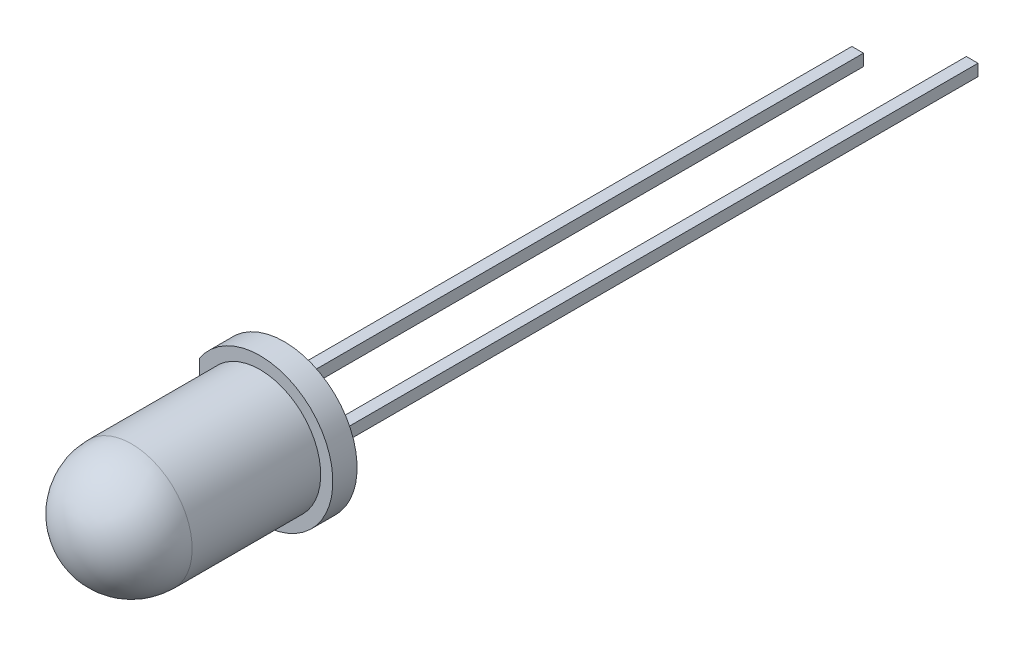
ISO-10303-21;
HEADER;
FILE_DESCRIPTION(('STEP AP214'),'2;1');
FILE_NAME('part.step','',(''),(''),'','','');
FILE_SCHEMA(('AUTOMOTIVE_DESIGN { 1 0 10303 214 1 1 1 1 }'));
ENDSEC;
DATA;
#1=APPLICATION_CONTEXT('core data for automotive mechanical design processes');
#2=APPLICATION_PROTOCOL_DEFINITION('international standard','automotive_design',2000,#1);
#3=PRODUCT_CONTEXT('',#1,'mechanical');
#4=PRODUCT('Part','Part','',(#3));
#5=PRODUCT_RELATED_PRODUCT_CATEGORY('part','',(#4));
#6=PRODUCT_DEFINITION_FORMATION('','',#4);
#7=PRODUCT_DEFINITION_CONTEXT('part definition',#1,'design');
#8=PRODUCT_DEFINITION('design','',#6,#7);
#9=PRODUCT_DEFINITION_SHAPE('','',#8);
#10=(LENGTH_UNIT() NAMED_UNIT(*) SI_UNIT(.MILLI.,.METRE.));
#11=(NAMED_UNIT(*) PLANE_ANGLE_UNIT() SI_UNIT($,.RADIAN.));
#12=(NAMED_UNIT(*) SI_UNIT($,.STERADIAN.) SOLID_ANGLE_UNIT());
#13=UNCERTAINTY_MEASURE_WITH_UNIT(LENGTH_MEASURE(1.E-05),#10,'distance_accuracy_value','');
#14=(GEOMETRIC_REPRESENTATION_CONTEXT(3) GLOBAL_UNCERTAINTY_ASSIGNED_CONTEXT((#13)) GLOBAL_UNIT_ASSIGNED_CONTEXT((#10,
#11,#12)) REPRESENTATION_CONTEXT('',''));
#15=CARTESIAN_POINT('',(0.,0.,0.));
#16=DIRECTION('',(0.,0.,1.));
#17=DIRECTION('',(1.,0.,0.));
#18=AXIS2_PLACEMENT_3D('',#15,#16,#17);
#19=CARTESIAN_POINT('',(-0.0499999999999997,0.,4.26666666666667));
#20=DIRECTION('',(0.,0.,1.));
#21=DIRECTION('',(-1.,0.,0.));
#22=AXIS2_PLACEMENT_3D('',#19,#20,#21);
#23=SPHERICAL_SURFACE('',#22,0.566666666666667);
#24=CARTESIAN_POINT('',(-0.0499999999999997,-0.24,4.26666666666667));
#25=DIRECTION('',(0.,1.,0.));
#26=DIRECTION('',(0.,0.,1.));
#27=AXIS2_PLACEMENT_3D('',#24,#25,#26);
#28=CIRCLE('',#27,0.513333333333333);
#29=CARTESIAN_POINT('',(-0.488634243989226,-0.24,4.));
#30=VERTEX_POINT('',#29);
#31=CARTESIAN_POINT('',(0.388634243989226,-0.24,4.));
#32=VERTEX_POINT('',#31);
#33=EDGE_CURVE('E165',#30,#32,#28,.F.);
#34=ORIENTED_EDGE('',*,*,#33,.T.);
#35=CARTESIAN_POINT('',(-0.0499999999999997,0.,4.));
#36=DIRECTION('',(0.,0.,1.));
#37=DIRECTION('',(1.,0.,0.));
#38=AXIS2_PLACEMENT_3D('',#35,#36,#37);
#39=CIRCLE('',#38,0.5);
#40=EDGE_CURVE('E60',#30,#32,#39,.T.);
#41=ORIENTED_EDGE('',*,*,#40,.F.);
#42=EDGE_LOOP('',(#34,#41));
#43=FACE_BOUND('',#42,.T.);
#44=ADVANCED_FACE('F52',(#43),#23,.T.);
#45=CARTESIAN_POINT('',(0.388634243989226,0.24,4.));
#46=VERTEX_POINT('',#45);
#47=CARTESIAN_POINT('',(-0.488634243989226,0.24,4.));
#48=VERTEX_POINT('',#47);
#49=EDGE_CURVE('E12',#46,#48,#39,.T.);
#50=ORIENTED_EDGE('',*,*,#49,.F.);
#51=CARTESIAN_POINT('',(-0.0499999999999997,0.24,4.26666666666667));
#52=DIRECTION('',(0.,1.,0.));
#53=DIRECTION('',(0.,0.,1.));
#54=AXIS2_PLACEMENT_3D('',#51,#52,#53);
#55=CIRCLE('',#54,0.513333333333333);
#56=EDGE_CURVE('E187',#48,#46,#55,.F.);
#57=ORIENTED_EDGE('',*,*,#56,.F.);
#58=EDGE_LOOP('',(#50,#57));
#59=FACE_BOUND('',#58,.T.);
#60=ADVANCED_FACE('F54',(#59),#23,.T.);
#61=CARTESIAN_POINT('',(-0.55,0.,4.));
#62=DIRECTION('',(0.,0.,-1.));
#63=DIRECTION('',(-1.,0.,0.));
#64=AXIS2_PLACEMENT_3D('',#61,#62,#63);
#65=PLANE('',#64);
#66=CARTESIAN_POINT('',(-0.0499999999999997,0.,4.));
#67=DIRECTION('',(0.,0.,1.));
#68=DIRECTION('',(1.,0.,0.));
#69=AXIS2_PLACEMENT_3D('',#66,#67,#68);
#70=CIRCLE('',#69,0.2);
#71=CARTESIAN_POINT('',(0.15,0.,4.));
#72=VERTEX_POINT('',#71);
#73=EDGE_CURVE('E260',#72,#72,#70,.T.);
#74=ORIENTED_EDGE('',*,*,#73,.F.);
#75=EDGE_LOOP('',(#74));
#76=FACE_BOUND('',#75,.T.);
#77=ORIENTED_EDGE('',*,*,#49,.T.);
#78=DIRECTION('',(1.,0.,0.));
#79=VECTOR('',#78,1.);
#80=CARTESIAN_POINT('',(-1.3,0.24,4.));
#81=LINE('',#80,#79);
#82=CARTESIAN_POINT('',(-1.3,0.24,4.));
#83=VERTEX_POINT('',#82);
#84=EDGE_CURVE('E106',#83,#48,#81,.T.);
#85=ORIENTED_EDGE('',*,*,#84,.F.);
#86=DIRECTION('',(0.,-1.,0.));
#87=VECTOR('',#86,1.);
#88=CARTESIAN_POINT('',(-1.3,0.24,4.));
#89=LINE('',#88,#87);
#90=CARTESIAN_POINT('',(-1.3,-0.24,4.));
#91=VERTEX_POINT('',#90);
#92=EDGE_CURVE('E164',#83,#91,#89,.T.);
#93=ORIENTED_EDGE('',*,*,#92,.T.);
#94=DIRECTION('',(1.,0.,0.));
#95=VECTOR('',#94,1.);
#96=CARTESIAN_POINT('',(-1.3,-0.24,4.));
#97=LINE('',#96,#95);
#98=EDGE_CURVE('E67',#91,#30,#97,.T.);
#99=ORIENTED_EDGE('',*,*,#98,.T.);
#100=ORIENTED_EDGE('',*,*,#40,.T.);
#101=CARTESIAN_POINT('',(1.2,-0.24,4.));
#102=VERTEX_POINT('',#101);
#103=EDGE_CURVE('E150',#32,#102,#97,.T.);
#104=ORIENTED_EDGE('',*,*,#103,.T.);
#105=DIRECTION('',(0.,-1.,0.));
#106=VECTOR('',#105,1.);
#107=CARTESIAN_POINT('',(1.2,0.24,4.));
#108=LINE('',#107,#106);
#109=CARTESIAN_POINT('',(1.2,0.24,4.));
#110=VERTEX_POINT('',#109);
#111=EDGE_CURVE('E134',#110,#102,#108,.T.);
#112=ORIENTED_EDGE('',*,*,#111,.F.);
#113=EDGE_CURVE('E122',#46,#110,#81,.T.);
#114=ORIENTED_EDGE('',*,*,#113,.F.);
#115=EDGE_LOOP('',(#77,#85,#93,#99,#100,#104,#112,#114));
#116=FACE_BOUND('',#115,.T.);
#117=ADVANCED_FACE('F170',(#76,#116),#65,.F.);
#118=CARTESIAN_POINT('',(0.,0.24,0.));
#119=DIRECTION('',(0.,1.,0.));
#120=DIRECTION('',(0.,0.,1.));
#121=AXIS2_PLACEMENT_3D('',#118,#119,#120);
#122=PLANE('',#121);
#123=ORIENTED_EDGE('',*,*,#84,.T.);
#124=ORIENTED_EDGE('',*,*,#56,.T.);
#125=ORIENTED_EDGE('',*,*,#113,.T.);
#126=DIRECTION('',(-0.508148861978286,0.,-0.861269257590315));
#127=VECTOR('',#126,1.);
#128=CARTESIAN_POINT('',(1.2,0.24,4.));
#129=LINE('',#128,#127);
#130=CARTESIAN_POINT('',(0.0199999999999998,0.24,2.));
#131=VERTEX_POINT('',#130);
#132=EDGE_CURVE('E113',#110,#131,#129,.T.);
#133=ORIENTED_EDGE('',*,*,#132,.T.);
#134=DIRECTION('',(-1.,0.,0.));
#135=VECTOR('',#134,1.);
#136=CARTESIAN_POINT('',(0.0199999999999998,0.24,2.));
#137=LINE('',#136,#135);
#138=CARTESIAN_POINT('',(-1.12,0.24,2.));
#139=VERTEX_POINT('',#138);
#140=EDGE_CURVE('E118',#131,#139,#137,.T.);
#141=ORIENTED_EDGE('',*,*,#140,.T.);
#142=DIRECTION('',(0.,0.,-1.));
#143=VECTOR('',#142,1.);
#144=CARTESIAN_POINT('',(-1.12,0.24,2.));
#145=LINE('',#144,#143);
#146=CARTESIAN_POINT('',(-1.12,0.24,-25.));
#147=VERTEX_POINT('',#146);
#148=EDGE_CURVE('E140',#139,#147,#145,.T.);
#149=ORIENTED_EDGE('',*,*,#148,.T.);
#150=DIRECTION('',(1.,0.,0.));
#151=VECTOR('',#150,1.);
#152=CARTESIAN_POINT('',(-1.12,0.24,-25.));
#153=LINE('',#152,#151);
#154=CARTESIAN_POINT('',(-1.6,0.24,-25.));
#155=VERTEX_POINT('',#154);
#156=EDGE_CURVE('E151',#155,#147,#153,.T.);
#157=ORIENTED_EDGE('',*,*,#156,.F.);
#158=DIRECTION('',(0.,0.,1.));
#159=VECTOR('',#158,1.);
#160=CARTESIAN_POINT('',(-1.6,0.24,0.));
#161=LINE('',#160,#159);
#162=CARTESIAN_POINT('',(-1.6,0.24,3.5));
#163=VERTEX_POINT('',#162);
#164=EDGE_CURVE('E76',#155,#163,#161,.T.);
#165=ORIENTED_EDGE('',*,*,#164,.T.);
#166=DIRECTION('',(0.514495755427526,0.,0.857492925712544));
#167=VECTOR('',#166,1.);
#168=CARTESIAN_POINT('',(-1.6,0.24,3.5));
#169=LINE('',#168,#167);
#170=EDGE_CURVE('E160',#163,#83,#169,.T.);
#171=ORIENTED_EDGE('',*,*,#170,.T.);
#172=EDGE_LOOP('',(#123,#124,#125,#133,#141,#149,#157,#165,#171));
#173=FACE_BOUND('',#172,.T.);
#174=ADVANCED_FACE('F115',(#173),#122,.T.);
#175=CARTESIAN_POINT('',(0.,-0.24,0.));
#176=DIRECTION('',(0.,1.,0.));
#177=DIRECTION('',(0.,0.,1.));
#178=AXIS2_PLACEMENT_3D('',#175,#176,#177);
#179=PLANE('',#178);
#180=ORIENTED_EDGE('',*,*,#33,.F.);
#181=ORIENTED_EDGE('',*,*,#98,.F.);
#182=DIRECTION('',(0.514495755427526,0.,0.857492925712544));
#183=VECTOR('',#182,1.);
#184=CARTESIAN_POINT('',(-1.6,-0.24,3.5));
#185=LINE('',#184,#183);
#186=CARTESIAN_POINT('',(-1.6,-0.24,3.5));
#187=VERTEX_POINT('',#186);
#188=EDGE_CURVE('E147',#187,#91,#185,.T.);
#189=ORIENTED_EDGE('',*,*,#188,.F.);
#190=DIRECTION('',(0.,0.,1.));
#191=VECTOR('',#190,1.);
#192=CARTESIAN_POINT('',(-1.6,-0.24,0.));
#193=LINE('',#192,#191);
#194=CARTESIAN_POINT('',(-1.6,-0.24,-25.));
#195=VERTEX_POINT('',#194);
#196=EDGE_CURVE('E100',#195,#187,#193,.T.);
#197=ORIENTED_EDGE('',*,*,#196,.F.);
#198=DIRECTION('',(-1.,0.,0.));
#199=VECTOR('',#198,1.);
#200=CARTESIAN_POINT('',(-1.12,-0.24,-25.));
#201=LINE('',#200,#199);
#202=CARTESIAN_POINT('',(-1.12,-0.24,-25.));
#203=VERTEX_POINT('',#202);
#204=EDGE_CURVE('E208',#203,#195,#201,.T.);
#205=ORIENTED_EDGE('',*,*,#204,.F.);
#206=DIRECTION('',(0.,0.,-1.));
#207=VECTOR('',#206,1.);
#208=CARTESIAN_POINT('',(-1.12,-0.24,2.));
#209=LINE('',#208,#207);
#210=CARTESIAN_POINT('',(-1.12,-0.24,2.));
#211=VERTEX_POINT('',#210);
#212=EDGE_CURVE('E156',#211,#203,#209,.T.);
#213=ORIENTED_EDGE('',*,*,#212,.F.);
#214=DIRECTION('',(-1.,0.,0.));
#215=VECTOR('',#214,1.);
#216=CARTESIAN_POINT('',(0.0199999999999998,-0.24,2.));
#217=LINE('',#216,#215);
#218=CARTESIAN_POINT('',(0.0199999999999998,-0.24,2.));
#219=VERTEX_POINT('',#218);
#220=EDGE_CURVE('E154',#219,#211,#217,.T.);
#221=ORIENTED_EDGE('',*,*,#220,.F.);
#222=DIRECTION('',(-0.508148861978286,0.,-0.861269257590315));
#223=VECTOR('',#222,1.);
#224=CARTESIAN_POINT('',(1.2,-0.24,4.));
#225=LINE('',#224,#223);
#226=EDGE_CURVE('E131',#102,#219,#225,.T.);
#227=ORIENTED_EDGE('',*,*,#226,.F.);
#228=ORIENTED_EDGE('',*,*,#103,.F.);
#229=EDGE_LOOP('',(#180,#181,#189,#197,#205,#213,#221,#227,#228));
#230=FACE_BOUND('',#229,.T.);
#231=ADVANCED_FACE('F222',(#230),#179,.F.);
#232=CARTESIAN_POINT('',(-1.6,0.24,3.5));
#233=DIRECTION('',(0.857492925712544,0.,-0.514495755427526));
#234=DIRECTION('',(-0.514495755427526,0.,-0.857492925712544));
#235=AXIS2_PLACEMENT_3D('',#232,#233,#234);
#236=PLANE('',#235);
#237=ORIENTED_EDGE('',*,*,#188,.T.);
#238=ORIENTED_EDGE('',*,*,#92,.F.);
#239=ORIENTED_EDGE('',*,*,#170,.F.);
#240=DIRECTION('',(0.,-1.,0.));
#241=VECTOR('',#240,1.);
#242=CARTESIAN_POINT('',(-1.6,0.24,3.5));
#243=LINE('',#242,#241);
#244=EDGE_CURVE('E146',#163,#187,#243,.T.);
#245=ORIENTED_EDGE('',*,*,#244,.T.);
#246=EDGE_LOOP('',(#237,#238,#239,#245));
#247=FACE_BOUND('',#246,.T.);
#248=ADVANCED_FACE('F219',(#247),#236,.F.);
#249=CARTESIAN_POINT('',(1.2,0.24,4.));
#250=DIRECTION('',(-0.861269257590315,0.,0.508148861978286));
#251=DIRECTION('',(0.508148861978286,0.,0.861269257590315));
#252=AXIS2_PLACEMENT_3D('',#249,#250,#251);
#253=PLANE('',#252);
#254=ORIENTED_EDGE('',*,*,#226,.T.);
#255=DIRECTION('',(0.,-1.,0.));
#256=VECTOR('',#255,1.);
#257=CARTESIAN_POINT('',(0.0199999999999998,0.24,2.));
#258=LINE('',#257,#256);
#259=EDGE_CURVE('E128',#131,#219,#258,.T.);
#260=ORIENTED_EDGE('',*,*,#259,.F.);
#261=ORIENTED_EDGE('',*,*,#132,.F.);
#262=ORIENTED_EDGE('',*,*,#111,.T.);
#263=EDGE_LOOP('',(#254,#260,#261,#262));
#264=FACE_BOUND('',#263,.T.);
#265=ADVANCED_FACE('F129',(#264),#253,.F.);
#266=CARTESIAN_POINT('',(0.0199999999999998,0.24,2.));
#267=DIRECTION('',(0.,0.,1.));
#268=DIRECTION('',(1.,0.,0.));
#269=AXIS2_PLACEMENT_3D('',#266,#267,#268);
#270=PLANE('',#269);
#271=ORIENTED_EDGE('',*,*,#220,.T.);
#272=DIRECTION('',(0.,-1.,0.));
#273=VECTOR('',#272,1.);
#274=CARTESIAN_POINT('',(-1.12,0.24,2.));
#275=LINE('',#274,#273);
#276=EDGE_CURVE('E135',#139,#211,#275,.T.);
#277=ORIENTED_EDGE('',*,*,#276,.F.);
#278=ORIENTED_EDGE('',*,*,#140,.F.);
#279=ORIENTED_EDGE('',*,*,#259,.T.);
#280=EDGE_LOOP('',(#271,#277,#278,#279));
#281=FACE_BOUND('',#280,.T.);
#282=ADVANCED_FACE('F137',(#281),#270,.F.);
#283=CARTESIAN_POINT('',(-1.12,0.24,2.));
#284=DIRECTION('',(-1.,0.,0.));
#285=DIRECTION('',(0.,0.,1.));
#286=AXIS2_PLACEMENT_3D('',#283,#284,#285);
#287=PLANE('',#286);
#288=ORIENTED_EDGE('',*,*,#212,.T.);
#289=DIRECTION('',(0.,-1.,0.));
#290=VECTOR('',#289,1.);
#291=CARTESIAN_POINT('',(-1.12,-0.24,-25.));
#292=LINE('',#291,#290);
#293=EDGE_CURVE('E202',#147,#203,#292,.T.);
#294=ORIENTED_EDGE('',*,*,#293,.F.);
#295=ORIENTED_EDGE('',*,*,#148,.F.);
#296=ORIENTED_EDGE('',*,*,#276,.T.);
#297=EDGE_LOOP('',(#288,#294,#295,#296));
#298=FACE_BOUND('',#297,.T.);
#299=ADVANCED_FACE('F205',(#298),#287,.F.);
#300=CARTESIAN_POINT('',(-1.6,0.24,0.));
#301=DIRECTION('',(1.,0.,0.));
#302=DIRECTION('',(0.,0.,-1.));
#303=AXIS2_PLACEMENT_3D('',#300,#301,#302);
#304=PLANE('',#303);
#305=ORIENTED_EDGE('',*,*,#196,.T.);
#306=ORIENTED_EDGE('',*,*,#244,.F.);
#307=ORIENTED_EDGE('',*,*,#164,.F.);
#308=DIRECTION('',(0.,1.,0.));
#309=VECTOR('',#308,1.);
#310=CARTESIAN_POINT('',(-1.6,-0.24,-25.));
#311=LINE('',#310,#309);
#312=EDGE_CURVE('E203',#195,#155,#311,.T.);
#313=ORIENTED_EDGE('',*,*,#312,.F.);
#314=EDGE_LOOP('',(#305,#306,#307,#313));
#315=FACE_BOUND('',#314,.T.);
#316=ADVANCED_FACE('F223',(#315),#304,.F.);
#317=CARTESIAN_POINT('',(0.,0.,-25.));
#318=DIRECTION('',(0.,0.,1.));
#319=DIRECTION('',(1.,0.,0.));
#320=AXIS2_PLACEMENT_3D('',#317,#318,#319);
#321=PLANE('',#320);
#322=ORIENTED_EDGE('',*,*,#293,.T.);
#323=ORIENTED_EDGE('',*,*,#204,.T.);
#324=ORIENTED_EDGE('',*,*,#312,.T.);
#325=ORIENTED_EDGE('',*,*,#156,.T.);
#326=EDGE_LOOP('',(#322,#323,#324,#325));
#327=FACE_BOUND('',#326,.T.);
#328=ADVANCED_FACE('F200',(#327),#321,.F.);
#329=CARTESIAN_POINT('',(-0.0499999999999997,0.,3.9));
#330=DIRECTION('',(0.,0.,1.));
#331=DIRECTION('',(1.,0.,0.));
#332=AXIS2_PLACEMENT_3D('',#329,#330,#331);
#333=CYLINDRICAL_SURFACE('',#332,0.2);
#334=CARTESIAN_POINT('',(-0.0499999999999997,0.,3.9));
#335=DIRECTION('',(0.,0.,1.));
#336=DIRECTION('',(1.,0.,0.));
#337=AXIS2_PLACEMENT_3D('',#334,#335,#336);
#338=CIRCLE('',#337,0.2);
#339=CARTESIAN_POINT('',(0.15,0.,3.9));
#340=VERTEX_POINT('',#339);
#341=EDGE_CURVE('E211',#340,#340,#338,.T.);
#342=ORIENTED_EDGE('',*,*,#341,.F.);
#343=EDGE_LOOP('',(#342));
#344=FACE_BOUND('',#343,.T.);
#345=ORIENTED_EDGE('',*,*,#73,.T.);
#346=EDGE_LOOP('',(#345));
#347=FACE_BOUND('',#346,.T.);
#348=ADVANCED_FACE('F230',(#344,#347),#333,.F.);
#349=CARTESIAN_POINT('',(-0.0499999999999997,0.,3.9));
#350=DIRECTION('',(0.,0.,1.));
#351=DIRECTION('',(1.,0.,0.));
#352=AXIS2_PLACEMENT_3D('',#349,#350,#351);
#353=PLANE('',#352);
#354=ORIENTED_EDGE('',*,*,#341,.T.);
#355=EDGE_LOOP('',(#354));
#356=FACE_BOUND('',#355,.T.);
#357=ADVANCED_FACE('F252',(#356),#353,.T.);
#358=CLOSED_SHELL('',(#44,#60,#117,#174,#231,#248,#265,#282,#299,#316,#328,#348,#357));
#359=MANIFOLD_SOLID_BREP('B2',#358);
#360=CARTESIAN_POINT('',(1.12,0.24,2.));
#361=DIRECTION('',(0.,0.,1.));
#362=DIRECTION('',(1.,0.,0.));
#363=AXIS2_PLACEMENT_3D('',#360,#361,#362);
#364=PLANE('',#363);
#365=DIRECTION('',(-1.,0.,0.));
#366=VECTOR('',#365,1.);
#367=CARTESIAN_POINT('',(1.12,-0.24,2.));
#368=LINE('',#367,#366);
#369=CARTESIAN_POINT('',(1.12,-0.24,2.));
#370=VERTEX_POINT('',#369);
#371=CARTESIAN_POINT('',(0.22,-0.24,2.));
#372=VERTEX_POINT('',#371);
#373=EDGE_CURVE('E457',#370,#372,#368,.T.);
#374=ORIENTED_EDGE('',*,*,#373,.T.);
#375=DIRECTION('',(0.,-1.,0.));
#376=VECTOR('',#375,1.);
#377=CARTESIAN_POINT('',(0.22,0.24,2.));
#378=LINE('',#377,#376);
#379=CARTESIAN_POINT('',(0.22,0.24,2.));
#380=VERTEX_POINT('',#379);
#381=EDGE_CURVE('E50',#380,#372,#378,.T.);
#382=ORIENTED_EDGE('',*,*,#381,.F.);
#383=DIRECTION('',(-1.,0.,0.));
#384=VECTOR('',#383,1.);
#385=CARTESIAN_POINT('',(1.12,0.24,2.));
#386=LINE('',#385,#384);
#387=CARTESIAN_POINT('',(1.12,0.24,2.));
#388=VERTEX_POINT('',#387);
#389=EDGE_CURVE('E458',#388,#380,#386,.T.);
#390=ORIENTED_EDGE('',*,*,#389,.F.);
#391=DIRECTION('',(0.,-1.,0.));
#392=VECTOR('',#391,1.);
#393=CARTESIAN_POINT('',(1.12,0.24,2.));
#394=LINE('',#393,#392);
#395=EDGE_CURVE('E463',#388,#370,#394,.T.);
#396=ORIENTED_EDGE('',*,*,#395,.T.);
#397=EDGE_LOOP('',(#374,#382,#390,#396));
#398=FACE_BOUND('',#397,.T.);
#399=ADVANCED_FACE('F371',(#398),#364,.F.);
#400=CARTESIAN_POINT('',(0.22,0.24,2.));
#401=DIRECTION('',(0.861269257590315,0.,-0.508148861978286));
#402=DIRECTION('',(-0.508148861978286,0.,-0.861269257590315));
#403=AXIS2_PLACEMENT_3D('',#400,#401,#402);
#404=PLANE('',#403);
#405=DIRECTION('',(0.508148861978286,0.,0.861269257590315));
#406=VECTOR('',#405,1.);
#407=CARTESIAN_POINT('',(0.22,-0.24,2.));
#408=LINE('',#407,#406);
#409=CARTESIAN_POINT('',(1.4,-0.24,4.));
#410=VERTEX_POINT('',#409);
#411=EDGE_CURVE('E466',#372,#410,#408,.T.);
#412=ORIENTED_EDGE('',*,*,#411,.T.);
#413=DIRECTION('',(0.,-1.,0.));
#414=VECTOR('',#413,1.);
#415=CARTESIAN_POINT('',(1.4,0.24,4.));
#416=LINE('',#415,#414);
#417=CARTESIAN_POINT('',(1.4,0.24,4.));
#418=VERTEX_POINT('',#417);
#419=EDGE_CURVE('E379',#418,#410,#416,.T.);
#420=ORIENTED_EDGE('',*,*,#419,.F.);
#421=DIRECTION('',(0.508148861978286,0.,0.861269257590315));
#422=VECTOR('',#421,1.);
#423=CARTESIAN_POINT('',(0.22,0.24,2.));
#424=LINE('',#423,#422);
#425=EDGE_CURVE('E420',#380,#418,#424,.T.);
#426=ORIENTED_EDGE('',*,*,#425,.F.);
#427=ORIENTED_EDGE('',*,*,#381,.T.);
#428=EDGE_LOOP('',(#412,#420,#426,#427));
#429=FACE_BOUND('',#428,.T.);
#430=ADVANCED_FACE('F481',(#429),#404,.F.);
#431=CARTESIAN_POINT('',(1.4,0.24,4.));
#432=DIRECTION('',(0.,0.,-1.));
#433=DIRECTION('',(-1.,0.,0.));
#434=AXIS2_PLACEMENT_3D('',#431,#432,#433);
#435=PLANE('',#434);
#436=DIRECTION('',(1.,0.,0.));
#437=VECTOR('',#436,1.);
#438=CARTESIAN_POINT('',(1.4,-0.24,4.));
#439=LINE('',#438,#437);
#440=CARTESIAN_POINT('',(1.6,-0.24,4.));
#441=VERTEX_POINT('',#440);
#442=EDGE_CURVE('E406',#410,#441,#439,.T.);
#443=ORIENTED_EDGE('',*,*,#442,.T.);
#444=DIRECTION('',(0.,-1.,0.));
#445=VECTOR('',#444,1.);
#446=CARTESIAN_POINT('',(1.6,0.24,4.));
#447=LINE('',#446,#445);
#448=CARTESIAN_POINT('',(1.6,0.24,4.));
#449=VERTEX_POINT('',#448);
#450=EDGE_CURVE('E472',#449,#441,#447,.T.);
#451=ORIENTED_EDGE('',*,*,#450,.F.);
#452=DIRECTION('',(1.,0.,0.));
#453=VECTOR('',#452,1.);
#454=CARTESIAN_POINT('',(1.4,0.24,4.));
#455=LINE('',#454,#453);
#456=EDGE_CURVE('E437',#418,#449,#455,.T.);
#457=ORIENTED_EDGE('',*,*,#456,.F.);
#458=ORIENTED_EDGE('',*,*,#419,.T.);
#459=EDGE_LOOP('',(#443,#451,#457,#458));
#460=FACE_BOUND('',#459,.T.);
#461=ADVANCED_FACE('F473',(#460),#435,.F.);
#462=CARTESIAN_POINT('',(1.6,0.24,4.));
#463=DIRECTION('',(-1.,0.,0.));
#464=DIRECTION('',(0.,0.,1.));
#465=AXIS2_PLACEMENT_3D('',#462,#463,#464);
#466=PLANE('',#465);
#467=DIRECTION('',(0.,0.,-1.));
#468=VECTOR('',#467,1.);
#469=CARTESIAN_POINT('',(1.6,-0.24,4.));
#470=LINE('',#469,#468);
#471=CARTESIAN_POINT('',(1.6,-0.24,-27.));
#472=VERTEX_POINT('',#471);
#473=EDGE_CURVE('E444',#441,#472,#470,.T.);
#474=ORIENTED_EDGE('',*,*,#473,.T.);
#475=DIRECTION('',(0.,-1.,0.));
#476=VECTOR('',#475,1.);
#477=CARTESIAN_POINT('',(1.6,0.24,-27.));
#478=LINE('',#477,#476);
#479=CARTESIAN_POINT('',(1.6,0.24,-27.));
#480=VERTEX_POINT('',#479);
#481=EDGE_CURVE('E441',#480,#472,#478,.T.);
#482=ORIENTED_EDGE('',*,*,#481,.F.);
#483=DIRECTION('',(0.,0.,-1.));
#484=VECTOR('',#483,1.);
#485=CARTESIAN_POINT('',(1.6,0.24,4.));
#486=LINE('',#485,#484);
#487=EDGE_CURVE('E431',#449,#480,#486,.T.);
#488=ORIENTED_EDGE('',*,*,#487,.F.);
#489=ORIENTED_EDGE('',*,*,#450,.T.);
#490=EDGE_LOOP('',(#474,#482,#488,#489));
#491=FACE_BOUND('',#490,.T.);
#492=ADVANCED_FACE('F442',(#491),#466,.F.);
#493=CARTESIAN_POINT('',(1.12,0.24,0.));
#494=DIRECTION('',(1.,0.,0.));
#495=DIRECTION('',(0.,0.,-1.));
#496=AXIS2_PLACEMENT_3D('',#493,#494,#495);
#497=PLANE('',#496);
#498=DIRECTION('',(0.,0.,1.));
#499=VECTOR('',#498,1.);
#500=CARTESIAN_POINT('',(1.12,-0.24,0.));
#501=LINE('',#500,#499);
#502=CARTESIAN_POINT('',(1.12,-0.24,-27.));
#503=VERTEX_POINT('',#502);
#504=EDGE_CURVE('E413',#503,#370,#501,.T.);
#505=ORIENTED_EDGE('',*,*,#504,.T.);
#506=ORIENTED_EDGE('',*,*,#395,.F.);
#507=DIRECTION('',(0.,0.,1.));
#508=VECTOR('',#507,1.);
#509=CARTESIAN_POINT('',(1.12,0.24,0.));
#510=LINE('',#509,#508);
#511=CARTESIAN_POINT('',(1.12,0.24,-27.));
#512=VERTEX_POINT('',#511);
#513=EDGE_CURVE('E387',#512,#388,#510,.T.);
#514=ORIENTED_EDGE('',*,*,#513,.F.);
#515=DIRECTION('',(0.,1.,0.));
#516=VECTOR('',#515,1.);
#517=CARTESIAN_POINT('',(1.12,-0.24,-27.));
#518=LINE('',#517,#516);
#519=EDGE_CURVE('E452',#503,#512,#518,.T.);
#520=ORIENTED_EDGE('',*,*,#519,.F.);
#521=EDGE_LOOP('',(#505,#506,#514,#520));
#522=FACE_BOUND('',#521,.T.);
#523=ADVANCED_FACE('F477',(#522),#497,.F.);
#524=CARTESIAN_POINT('',(0.,0.24,0.));
#525=DIRECTION('',(0.,-1.,0.));
#526=DIRECTION('',(0.,0.,-1.));
#527=AXIS2_PLACEMENT_3D('',#524,#525,#526);
#528=PLANE('',#527);
#529=ORIENTED_EDGE('',*,*,#389,.T.);
#530=ORIENTED_EDGE('',*,*,#425,.T.);
#531=ORIENTED_EDGE('',*,*,#456,.T.);
#532=ORIENTED_EDGE('',*,*,#487,.T.);
#533=DIRECTION('',(1.,0.,0.));
#534=VECTOR('',#533,1.);
#535=CARTESIAN_POINT('',(1.12,0.24,-27.));
#536=LINE('',#535,#534);
#537=EDGE_CURVE('E435',#512,#480,#536,.T.);
#538=ORIENTED_EDGE('',*,*,#537,.F.);
#539=ORIENTED_EDGE('',*,*,#513,.T.);
#540=EDGE_LOOP('',(#529,#530,#531,#532,#538,#539));
#541=FACE_BOUND('',#540,.T.);
#542=ADVANCED_FACE('F433',(#541),#528,.F.);
#543=CARTESIAN_POINT('',(0.,-0.24,0.));
#544=DIRECTION('',(0.,-1.,0.));
#545=DIRECTION('',(0.,0.,-1.));
#546=AXIS2_PLACEMENT_3D('',#543,#544,#545);
#547=PLANE('',#546);
#548=ORIENTED_EDGE('',*,*,#373,.F.);
#549=ORIENTED_EDGE('',*,*,#504,.F.);
#550=DIRECTION('',(-1.,0.,0.));
#551=VECTOR('',#550,1.);
#552=CARTESIAN_POINT('',(1.6,-0.24,-27.));
#553=LINE('',#552,#551);
#554=EDGE_CURVE('E448',#472,#503,#553,.T.);
#555=ORIENTED_EDGE('',*,*,#554,.F.);
#556=ORIENTED_EDGE('',*,*,#473,.F.);
#557=ORIENTED_EDGE('',*,*,#442,.F.);
#558=ORIENTED_EDGE('',*,*,#411,.F.);
#559=EDGE_LOOP('',(#548,#549,#555,#556,#557,#558));
#560=FACE_BOUND('',#559,.T.);
#561=ADVANCED_FACE('F476',(#560),#547,.T.);
#562=CARTESIAN_POINT('',(0.,0.,-27.));
#563=DIRECTION('',(0.,0.,-1.));
#564=DIRECTION('',(-1.,0.,0.));
#565=AXIS2_PLACEMENT_3D('',#562,#563,#564);
#566=PLANE('',#565);
#567=ORIENTED_EDGE('',*,*,#537,.T.);
#568=ORIENTED_EDGE('',*,*,#481,.T.);
#569=ORIENTED_EDGE('',*,*,#554,.T.);
#570=ORIENTED_EDGE('',*,*,#519,.T.);
#571=EDGE_LOOP('',(#567,#568,#569,#570));
#572=FACE_BOUND('',#571,.T.);
#573=ADVANCED_FACE('F451',(#572),#566,.T.);
#574=CLOSED_SHELL('',(#399,#430,#461,#492,#523,#542,#561,#573));
#575=MANIFOLD_SOLID_BREP('B6',#574);
#576=CARTESIAN_POINT('',(0.,0.,1.));
#577=DIRECTION('',(0.,0.,-1.));
#578=DIRECTION('',(-1.,0.,0.));
#579=AXIS2_PLACEMENT_3D('',#576,#577,#578);
#580=CYLINDRICAL_SURFACE('',#579,3.);
#581=CARTESIAN_POINT('',(0.,0.,1.));
#582=DIRECTION('',(0.,0.,1.));
#583=DIRECTION('',(1.,0.,0.));
#584=AXIS2_PLACEMENT_3D('',#581,#582,#583);
#585=CIRCLE('',#584,3.);
#586=CARTESIAN_POINT('',(-2.5,-1.6583123951777,1.));
#587=VERTEX_POINT('',#586);
#588=CARTESIAN_POINT('',(-2.5,1.6583123951777,1.));
#589=VERTEX_POINT('',#588);
#590=EDGE_CURVE('E582',#587,#589,#585,.T.);
#591=ORIENTED_EDGE('',*,*,#590,.F.);
#592=DIRECTION('',(0.,0.,-1.));
#593=VECTOR('',#592,1.);
#594=CARTESIAN_POINT('',(-2.5,-1.6583123951777,4.35410196624969));
#595=LINE('',#594,#593);
#596=CARTESIAN_POINT('',(-2.5,-1.6583123951777,0.));
#597=VERTEX_POINT('',#596);
#598=EDGE_CURVE('E772',#587,#597,#595,.T.);
#599=ORIENTED_EDGE('',*,*,#598,.T.);
#600=CARTESIAN_POINT('',(0.,0.,0.));
#601=DIRECTION('',(0.,0.,1.));
#602=DIRECTION('',(1.,0.,0.));
#603=AXIS2_PLACEMENT_3D('',#600,#601,#602);
#604=CIRCLE('',#603,3.);
#605=CARTESIAN_POINT('',(-2.5,1.6583123951777,0.));
#606=VERTEX_POINT('',#605);
#607=EDGE_CURVE('E780',#597,#606,#604,.T.);
#608=ORIENTED_EDGE('',*,*,#607,.T.);
#609=DIRECTION('',(0.,0.,-1.));
#610=VECTOR('',#609,1.);
#611=CARTESIAN_POINT('',(-2.5,1.6583123951777,4.35410196624969));
#612=LINE('',#611,#610);
#613=EDGE_CURVE('E775',#589,#606,#612,.T.);
#614=ORIENTED_EDGE('',*,*,#613,.F.);
#615=EDGE_LOOP('',(#591,#599,#608,#614));
#616=FACE_BOUND('',#615,.T.);
#617=ADVANCED_FACE('F575',(#616),#580,.T.);
#618=CARTESIAN_POINT('',(0.,0.,1.));
#619=DIRECTION('',(0.,0.,1.));
#620=DIRECTION('',(1.,0.,0.));
#621=AXIS2_PLACEMENT_3D('',#618,#619,#620);
#622=PLANE('',#621);
#623=DIRECTION('',(0.,-1.,0.));
#624=VECTOR('',#623,1.);
#625=CARTESIAN_POINT('',(-2.5,1.6583123951777,1.));
#626=LINE('',#625,#624);
#627=CARTESIAN_POINT('',(-2.5,0.,1.));
#628=VERTEX_POINT('',#627);
#629=EDGE_CURVE('E767',#628,#587,#626,.T.);
#630=ORIENTED_EDGE('',*,*,#629,.T.);
#631=ORIENTED_EDGE('',*,*,#590,.T.);
#632=EDGE_CURVE('E769',#589,#628,#626,.T.);
#633=ORIENTED_EDGE('',*,*,#632,.T.);
#634=CARTESIAN_POINT('',(0.,0.,1.));
#635=DIRECTION('',(0.,0.,1.));
#636=DIRECTION('',(1.,0.,0.));
#637=AXIS2_PLACEMENT_3D('',#634,#635,#636);
#638=CIRCLE('',#637,2.5);
#639=EDGE_CURVE('E369',#628,#628,#638,.T.);
#640=ORIENTED_EDGE('',*,*,#639,.F.);
#641=EDGE_LOOP('',(#630,#631,#633,#640));
#642=FACE_BOUND('',#641,.T.);
#643=ADVANCED_FACE('F794',(#642),#622,.T.);
#644=CARTESIAN_POINT('',(0.,0.,0.));
#645=DIRECTION('',(0.,0.,1.));
#646=DIRECTION('',(1.,0.,0.));
#647=AXIS2_PLACEMENT_3D('',#644,#645,#646);
#648=PLANE('',#647);
#649=DIRECTION('',(0.,1.,0.));
#650=VECTOR('',#649,1.);
#651=CARTESIAN_POINT('',(-1.6,-0.24,0.));
#652=LINE('',#651,#650);
#653=CARTESIAN_POINT('',(-1.6,-0.24,0.));
#654=VERTEX_POINT('',#653);
#655=CARTESIAN_POINT('',(-1.6,0.24,0.));
#656=VERTEX_POINT('',#655);
#657=EDGE_CURVE('E689',#654,#656,#652,.T.);
#658=ORIENTED_EDGE('',*,*,#657,.F.);
#659=DIRECTION('',(-1.,0.,0.));
#660=VECTOR('',#659,1.);
#661=CARTESIAN_POINT('',(-1.6,-0.24,0.));
#662=LINE('',#661,#660);
#663=CARTESIAN_POINT('',(-1.12,-0.24,0.));
#664=VERTEX_POINT('',#663);
#665=EDGE_CURVE('E696',#664,#654,#662,.T.);
#666=ORIENTED_EDGE('',*,*,#665,.F.);
#667=DIRECTION('',(0.,1.,0.));
#668=VECTOR('',#667,1.);
#669=CARTESIAN_POINT('',(-1.12,-0.24,0.));
#670=LINE('',#669,#668);
#671=CARTESIAN_POINT('',(-1.12,0.24,0.));
#672=VERTEX_POINT('',#671);
#673=EDGE_CURVE('E768',#664,#672,#670,.T.);
#674=ORIENTED_EDGE('',*,*,#673,.T.);
#675=DIRECTION('',(-1.,0.,0.));
#676=VECTOR('',#675,1.);
#677=CARTESIAN_POINT('',(-1.6,0.24,0.));
#678=LINE('',#677,#676);
#679=EDGE_CURVE('E710',#672,#656,#678,.T.);
#680=ORIENTED_EDGE('',*,*,#679,.T.);
#681=EDGE_LOOP('',(#658,#666,#674,#680));
#682=FACE_BOUND('',#681,.T.);
#683=DIRECTION('',(0.,1.,0.));
#684=VECTOR('',#683,1.);
#685=CARTESIAN_POINT('',(1.12,-0.24,0.));
#686=LINE('',#685,#684);
#687=CARTESIAN_POINT('',(1.12,-0.24,0.));
#688=VERTEX_POINT('',#687);
#689=CARTESIAN_POINT('',(1.12,0.24,0.));
#690=VERTEX_POINT('',#689);
#691=EDGE_CURVE('E737',#688,#690,#686,.T.);
#692=ORIENTED_EDGE('',*,*,#691,.F.);
#693=DIRECTION('',(-1.,0.,0.));
#694=VECTOR('',#693,1.);
#695=CARTESIAN_POINT('',(1.12,-0.24,0.));
#696=LINE('',#695,#694);
#697=CARTESIAN_POINT('',(1.6,-0.24,0.));
#698=VERTEX_POINT('',#697);
#699=EDGE_CURVE('E718',#698,#688,#696,.T.);
#700=ORIENTED_EDGE('',*,*,#699,.F.);
#701=DIRECTION('',(0.,1.,0.));
#702=VECTOR('',#701,1.);
#703=CARTESIAN_POINT('',(1.6,-0.24,0.));
#704=LINE('',#703,#702);
#705=CARTESIAN_POINT('',(1.6,0.24,0.));
#706=VERTEX_POINT('',#705);
#707=EDGE_CURVE('E753',#698,#706,#704,.T.);
#708=ORIENTED_EDGE('',*,*,#707,.T.);
#709=DIRECTION('',(-1.,0.,0.));
#710=VECTOR('',#709,1.);
#711=CARTESIAN_POINT('',(1.12,0.24,0.));
#712=LINE('',#711,#710);
#713=EDGE_CURVE('E738',#706,#690,#712,.T.);
#714=ORIENTED_EDGE('',*,*,#713,.T.);
#715=EDGE_LOOP('',(#692,#700,#708,#714));
#716=FACE_BOUND('',#715,.T.);
#717=ORIENTED_EDGE('',*,*,#607,.F.);
#718=DIRECTION('',(0.,-1.,0.));
#719=VECTOR('',#718,1.);
#720=CARTESIAN_POINT('',(-2.5,1.6583123951777,0.));
#721=LINE('',#720,#719);
#722=EDGE_CURVE('E765',#606,#597,#721,.T.);
#723=ORIENTED_EDGE('',*,*,#722,.F.);
#724=EDGE_LOOP('',(#717,#723));
#725=FACE_BOUND('',#724,.T.);
#726=ADVANCED_FACE('F708',(#682,#716,#725),#648,.F.);
#727=CARTESIAN_POINT('',(0.,0.,6.3));
#728=DIRECTION('',(0.,0.,-1.));
#729=DIRECTION('',(0.,1.,0.));
#730=AXIS2_PLACEMENT_3D('',#727,#728,#729);
#731=SPHERICAL_SURFACE('',#730,2.5);
#732=CARTESIAN_POINT('',(0.,0.,6.3));
#733=DIRECTION('',(0.,0.,-1.));
#734=DIRECTION('',(0.,1.,0.));
#735=AXIS2_PLACEMENT_3D('',#732,#733,#734);
#736=CIRCLE('',#735,2.5);
#737=CARTESIAN_POINT('',(0.,2.5,6.3));
#738=VERTEX_POINT('',#737);
#739=EDGE_CURVE('E777',#738,#738,#736,.T.);
#740=ORIENTED_EDGE('',*,*,#739,.F.);
#741=EDGE_LOOP('',(#740));
#742=FACE_BOUND('',#741,.T.);
#743=ADVANCED_FACE('F798',(#742),#731,.T.);
#744=CARTESIAN_POINT('',(0.,0.,1.));
#745=DIRECTION('',(0.,0.,-1.));
#746=DIRECTION('',(0.,1.,0.));
#747=AXIS2_PLACEMENT_3D('',#744,#745,#746);
#748=CYLINDRICAL_SURFACE('',#747,2.5);
#749=ORIENTED_EDGE('',*,*,#739,.T.);
#750=EDGE_LOOP('',(#749));
#751=FACE_BOUND('',#750,.T.);
#752=ORIENTED_EDGE('',*,*,#639,.T.);
#753=EDGE_LOOP('',(#752));
#754=FACE_BOUND('',#753,.T.);
#755=ADVANCED_FACE('F796',(#751,#754),#748,.T.);
#756=CARTESIAN_POINT('',(-2.5,1.6583123951777,4.35410196624969));
#757=DIRECTION('',(1.,0.,0.));
#758=DIRECTION('',(0.,0.,-1.));
#759=AXIS2_PLACEMENT_3D('',#756,#757,#758);
#760=PLANE('',#759);
#761=ORIENTED_EDGE('',*,*,#613,.T.);
#762=ORIENTED_EDGE('',*,*,#722,.T.);
#763=ORIENTED_EDGE('',*,*,#598,.F.);
#764=ORIENTED_EDGE('',*,*,#629,.F.);
#765=ORIENTED_EDGE('',*,*,#632,.F.);
#766=EDGE_LOOP('',(#761,#762,#763,#764,#765));
#767=FACE_BOUND('',#766,.T.);
#768=ADVANCED_FACE('F790',(#767),#760,.F.);
#769=CARTESIAN_POINT('',(1.6,-0.24,0.));
#770=DIRECTION('',(1.,0.,0.));
#771=DIRECTION('',(0.,0.,-1.));
#772=AXIS2_PLACEMENT_3D('',#769,#770,#771);
#773=PLANE('',#772);
#774=DIRECTION('',(0.,0.,-1.));
#775=VECTOR('',#774,1.);
#776=CARTESIAN_POINT('',(1.6,0.24,0.));
#777=LINE('',#776,#775);
#778=CARTESIAN_POINT('',(1.6,0.24,4.));
#779=VERTEX_POINT('',#778);
#780=EDGE_CURVE('E722',#779,#706,#777,.T.);
#781=ORIENTED_EDGE('',*,*,#780,.T.);
#782=ORIENTED_EDGE('',*,*,#707,.F.);
#783=DIRECTION('',(0.,0.,-1.));
#784=VECTOR('',#783,1.);
#785=CARTESIAN_POINT('',(1.6,-0.24,0.));
#786=LINE('',#785,#784);
#787=CARTESIAN_POINT('',(1.6,-0.24,4.));
#788=VERTEX_POINT('',#787);
#789=EDGE_CURVE('E734',#788,#698,#786,.T.);
#790=ORIENTED_EDGE('',*,*,#789,.F.);
#791=DIRECTION('',(0.,1.,0.));
#792=VECTOR('',#791,1.);
#793=CARTESIAN_POINT('',(1.6,-0.24,4.));
#794=LINE('',#793,#792);
#795=EDGE_CURVE('E756',#788,#779,#794,.T.);
#796=ORIENTED_EDGE('',*,*,#795,.T.);
#797=EDGE_LOOP('',(#781,#782,#790,#796));
#798=FACE_BOUND('',#797,.T.);
#799=ADVANCED_FACE('F805',(#798),#773,.F.);
#800=CARTESIAN_POINT('',(1.6,-0.24,4.));
#801=DIRECTION('',(0.,0.,1.));
#802=DIRECTION('',(1.,0.,0.));
#803=AXIS2_PLACEMENT_3D('',#800,#801,#802);
#804=PLANE('',#803);
#805=DIRECTION('',(1.,0.,0.));
#806=VECTOR('',#805,1.);
#807=CARTESIAN_POINT('',(1.6,0.24,4.));
#808=LINE('',#807,#806);
#809=CARTESIAN_POINT('',(1.4,0.24,4.));
#810=VERTEX_POINT('',#809);
#811=EDGE_CURVE('E748',#810,#779,#808,.T.);
#812=ORIENTED_EDGE('',*,*,#811,.T.);
#813=ORIENTED_EDGE('',*,*,#795,.F.);
#814=DIRECTION('',(1.,0.,0.));
#815=VECTOR('',#814,1.);
#816=CARTESIAN_POINT('',(1.6,-0.24,4.));
#817=LINE('',#816,#815);
#818=CARTESIAN_POINT('',(1.4,-0.24,4.));
#819=VERTEX_POINT('',#818);
#820=EDGE_CURVE('E731',#819,#788,#817,.T.);
#821=ORIENTED_EDGE('',*,*,#820,.F.);
#822=DIRECTION('',(0.,1.,0.));
#823=VECTOR('',#822,1.);
#824=CARTESIAN_POINT('',(1.4,-0.24,4.));
#825=LINE('',#824,#823);
#826=EDGE_CURVE('E758',#819,#810,#825,.T.);
#827=ORIENTED_EDGE('',*,*,#826,.T.);
#828=EDGE_LOOP('',(#812,#813,#821,#827));
#829=FACE_BOUND('',#828,.T.);
#830=ADVANCED_FACE('F850',(#829),#804,.F.);
#831=CARTESIAN_POINT('',(1.4,-0.24,4.));
#832=DIRECTION('',(-0.861269257590315,0.,0.508148861978286));
#833=DIRECTION('',(0.508148861978286,0.,0.861269257590315));
#834=AXIS2_PLACEMENT_3D('',#831,#832,#833);
#835=PLANE('',#834);
#836=DIRECTION('',(0.508148861978286,0.,0.861269257590315));
#837=VECTOR('',#836,1.);
#838=CARTESIAN_POINT('',(1.4,0.24,4.));
#839=LINE('',#838,#837);
#840=CARTESIAN_POINT('',(0.22,0.24,2.));
#841=VERTEX_POINT('',#840);
#842=EDGE_CURVE('E745',#841,#810,#839,.T.);
#843=ORIENTED_EDGE('',*,*,#842,.T.);
#844=ORIENTED_EDGE('',*,*,#826,.F.);
#845=DIRECTION('',(0.508148861978286,0.,0.861269257590315));
#846=VECTOR('',#845,1.);
#847=CARTESIAN_POINT('',(1.4,-0.24,4.));
#848=LINE('',#847,#846);
#849=CARTESIAN_POINT('',(0.22,-0.24,2.));
#850=VERTEX_POINT('',#849);
#851=EDGE_CURVE('E728',#850,#819,#848,.T.);
#852=ORIENTED_EDGE('',*,*,#851,.F.);
#853=DIRECTION('',(0.,1.,0.));
#854=VECTOR('',#853,1.);
#855=CARTESIAN_POINT('',(0.22,-0.24,2.));
#856=LINE('',#855,#854);
#857=EDGE_CURVE('E760',#850,#841,#856,.T.);
#858=ORIENTED_EDGE('',*,*,#857,.T.);
#859=EDGE_LOOP('',(#843,#844,#852,#858));
#860=FACE_BOUND('',#859,.T.);
#861=ADVANCED_FACE('F857',(#860),#835,.F.);
#862=CARTESIAN_POINT('',(0.22,-0.24,2.));
#863=DIRECTION('',(0.,0.,-1.));
#864=DIRECTION('',(-1.,0.,0.));
#865=AXIS2_PLACEMENT_3D('',#862,#863,#864);
#866=PLANE('',#865);
#867=DIRECTION('',(-1.,0.,0.));
#868=VECTOR('',#867,1.);
#869=CARTESIAN_POINT('',(0.22,0.24,2.));
#870=LINE('',#869,#868);
#871=CARTESIAN_POINT('',(1.12,0.24,2.));
#872=VERTEX_POINT('',#871);
#873=EDGE_CURVE('E742',#872,#841,#870,.T.);
#874=ORIENTED_EDGE('',*,*,#873,.T.);
#875=ORIENTED_EDGE('',*,*,#857,.F.);
#876=DIRECTION('',(-1.,0.,0.));
#877=VECTOR('',#876,1.);
#878=CARTESIAN_POINT('',(0.22,-0.24,2.));
#879=LINE('',#878,#877);
#880=CARTESIAN_POINT('',(1.12,-0.24,2.));
#881=VERTEX_POINT('',#880);
#882=EDGE_CURVE('E725',#881,#850,#879,.T.);
#883=ORIENTED_EDGE('',*,*,#882,.F.);
#884=DIRECTION('',(0.,1.,0.));
#885=VECTOR('',#884,1.);
#886=CARTESIAN_POINT('',(1.12,-0.24,2.));
#887=LINE('',#886,#885);
#888=EDGE_CURVE('E762',#881,#872,#887,.T.);
#889=ORIENTED_EDGE('',*,*,#888,.T.);
#890=EDGE_LOOP('',(#874,#875,#883,#889));
#891=FACE_BOUND('',#890,.T.);
#892=ADVANCED_FACE('F865',(#891),#866,.F.);
#893=CARTESIAN_POINT('',(1.12,-0.24,2.));
#894=DIRECTION('',(-1.,0.,0.));
#895=DIRECTION('',(0.,0.,1.));
#896=AXIS2_PLACEMENT_3D('',#893,#894,#895);
#897=PLANE('',#896);
#898=DIRECTION('',(0.,0.,1.));
#899=VECTOR('',#898,1.);
#900=CARTESIAN_POINT('',(1.12,0.24,2.));
#901=LINE('',#900,#899);
#902=EDGE_CURVE('E597',#690,#872,#901,.T.);
#903=ORIENTED_EDGE('',*,*,#902,.T.);
#904=ORIENTED_EDGE('',*,*,#888,.F.);
#905=DIRECTION('',(0.,0.,1.));
#906=VECTOR('',#905,1.);
#907=CARTESIAN_POINT('',(1.12,-0.24,2.));
#908=LINE('',#907,#906);
#909=EDGE_CURVE('E721',#688,#881,#908,.T.);
#910=ORIENTED_EDGE('',*,*,#909,.F.);
#911=ORIENTED_EDGE('',*,*,#691,.T.);
#912=EDGE_LOOP('',(#903,#904,#910,#911));
#913=FACE_BOUND('',#912,.T.);
#914=ADVANCED_FACE('F873',(#913),#897,.F.);
#915=CARTESIAN_POINT('',(0.,-0.24,0.));
#916=DIRECTION('',(0.,-1.,0.));
#917=DIRECTION('',(0.,0.,-1.));
#918=AXIS2_PLACEMENT_3D('',#915,#916,#917);
#919=PLANE('',#918);
#920=ORIENTED_EDGE('',*,*,#699,.T.);
#921=ORIENTED_EDGE('',*,*,#909,.T.);
#922=ORIENTED_EDGE('',*,*,#882,.T.);
#923=ORIENTED_EDGE('',*,*,#851,.T.);
#924=ORIENTED_EDGE('',*,*,#820,.T.);
#925=ORIENTED_EDGE('',*,*,#789,.T.);
#926=EDGE_LOOP('',(#920,#921,#922,#923,#924,#925));
#927=FACE_BOUND('',#926,.T.);
#928=ADVANCED_FACE('F881',(#927),#919,.F.);
#929=CARTESIAN_POINT('',(0.,0.24,0.));
#930=DIRECTION('',(0.,-1.,0.));
#931=DIRECTION('',(0.,0.,-1.));
#932=AXIS2_PLACEMENT_3D('',#929,#930,#931);
#933=PLANE('',#932);
#934=ORIENTED_EDGE('',*,*,#713,.F.);
#935=ORIENTED_EDGE('',*,*,#780,.F.);
#936=ORIENTED_EDGE('',*,*,#811,.F.);
#937=ORIENTED_EDGE('',*,*,#842,.F.);
#938=ORIENTED_EDGE('',*,*,#873,.F.);
#939=ORIENTED_EDGE('',*,*,#902,.F.);
#940=EDGE_LOOP('',(#934,#935,#936,#937,#938,#939));
#941=FACE_BOUND('',#940,.T.);
#942=ADVANCED_FACE('F889',(#941),#933,.T.);
#943=CARTESIAN_POINT('',(-1.12,-0.24,0.));
#944=DIRECTION('',(1.,0.,0.));
#945=DIRECTION('',(0.,0.,-1.));
#946=AXIS2_PLACEMENT_3D('',#943,#944,#945);
#947=PLANE('',#946);
#948=DIRECTION('',(0.,0.,-1.));
#949=VECTOR('',#948,1.);
#950=CARTESIAN_POINT('',(-1.12,0.24,0.));
#951=LINE('',#950,#949);
#952=CARTESIAN_POINT('',(-1.12,0.24,2.));
#953=VERTEX_POINT('',#952);
#954=EDGE_CURVE('E706',#953,#672,#951,.T.);
#955=ORIENTED_EDGE('',*,*,#954,.T.);
#956=ORIENTED_EDGE('',*,*,#673,.F.);
#957=DIRECTION('',(0.,0.,-1.));
#958=VECTOR('',#957,1.);
#959=CARTESIAN_POINT('',(-1.12,-0.24,0.));
#960=LINE('',#959,#958);
#961=CARTESIAN_POINT('',(-1.12,-0.24,2.));
#962=VERTEX_POINT('',#961);
#963=EDGE_CURVE('E703',#962,#664,#960,.T.);
#964=ORIENTED_EDGE('',*,*,#963,.F.);
#965=DIRECTION('',(0.,1.,0.));
#966=VECTOR('',#965,1.);
#967=CARTESIAN_POINT('',(-1.12,-0.24,2.));
#968=LINE('',#967,#966);
#969=EDGE_CURVE('E992',#962,#953,#968,.T.);
#970=ORIENTED_EDGE('',*,*,#969,.T.);
#971=EDGE_LOOP('',(#955,#956,#964,#970));
#972=FACE_BOUND('',#971,.T.);
#973=ADVANCED_FACE('F897',(#972),#947,.F.);
#974=CARTESIAN_POINT('',(-1.12,-0.24,2.));
#975=DIRECTION('',(0.,0.,-1.));
#976=DIRECTION('',(-1.,0.,0.));
#977=AXIS2_PLACEMENT_3D('',#974,#975,#976);
#978=PLANE('',#977);
#979=DIRECTION('',(-1.,0.,0.));
#980=VECTOR('',#979,1.);
#981=CARTESIAN_POINT('',(-1.12,0.24,2.));
#982=LINE('',#981,#980);
#983=CARTESIAN_POINT('',(0.0199999999999998,0.24,2.));
#984=VERTEX_POINT('',#983);
#985=EDGE_CURVE('E994',#984,#953,#982,.T.);
#986=ORIENTED_EDGE('',*,*,#985,.T.);
#987=ORIENTED_EDGE('',*,*,#969,.F.);
#988=DIRECTION('',(-1.,0.,0.));
#989=VECTOR('',#988,1.);
#990=CARTESIAN_POINT('',(-1.12,-0.24,2.));
#991=LINE('',#990,#989);
#992=CARTESIAN_POINT('',(0.0199999999999998,-0.24,2.));
#993=VERTEX_POINT('',#992);
#994=EDGE_CURVE('E714',#993,#962,#991,.T.);
#995=ORIENTED_EDGE('',*,*,#994,.F.);
#996=DIRECTION('',(0.,1.,0.));
#997=VECTOR('',#996,1.);
#998=CARTESIAN_POINT('',(0.0199999999999998,-0.24,2.));
#999=LINE('',#998,#997);
#1000=EDGE_CURVE('E997',#993,#984,#999,.T.);
#1001=ORIENTED_EDGE('',*,*,#1000,.T.);
#1002=EDGE_LOOP('',(#986,#987,#995,#1001));
#1003=FACE_BOUND('',#1002,.T.);
#1004=ADVANCED_FACE('F904',(#1003),#978,.F.);
#1005=CARTESIAN_POINT('',(0.0199999999999998,-0.24,2.));
#1006=DIRECTION('',(0.861269257590315,0.,-0.508148861978286));
#1007=DIRECTION('',(-0.508148861978286,0.,-0.861269257590315));
#1008=AXIS2_PLACEMENT_3D('',#1005,#1006,#1007);
#1009=PLANE('',#1008);
#1010=DIRECTION('',(-0.508148861978286,0.,-0.861269257590315));
#1011=VECTOR('',#1010,1.);
#1012=CARTESIAN_POINT('',(0.0199999999999998,0.24,2.));
#1013=LINE('',#1012,#1011);
#1014=CARTESIAN_POINT('',(1.2,0.24,4.));
#1015=VERTEX_POINT('',#1014);
#1016=EDGE_CURVE('E1013',#1015,#984,#1013,.T.);
#1017=ORIENTED_EDGE('',*,*,#1016,.T.);
#1018=ORIENTED_EDGE('',*,*,#1000,.F.);
#1019=DIRECTION('',(-0.508148861978286,0.,-0.861269257590315));
#1020=VECTOR('',#1019,1.);
#1021=CARTESIAN_POINT('',(0.0199999999999998,-0.24,2.));
#1022=LINE('',#1021,#1020);
#1023=CARTESIAN_POINT('',(1.2,-0.24,4.));
#1024=VERTEX_POINT('',#1023);
#1025=EDGE_CURVE('E1021',#1024,#993,#1022,.T.);
#1026=ORIENTED_EDGE('',*,*,#1025,.F.);
#1027=DIRECTION('',(0.,1.,0.));
#1028=VECTOR('',#1027,1.);
#1029=CARTESIAN_POINT('',(1.2,-0.24,4.));
#1030=LINE('',#1029,#1028);
#1031=EDGE_CURVE('E1002',#1024,#1015,#1030,.T.);
#1032=ORIENTED_EDGE('',*,*,#1031,.T.);
#1033=EDGE_LOOP('',(#1017,#1018,#1026,#1032));
#1034=FACE_BOUND('',#1033,.T.);
#1035=ADVANCED_FACE('F912',(#1034),#1009,.F.);
#1036=CARTESIAN_POINT('',(1.2,-0.24,4.));
#1037=DIRECTION('',(0.,0.,1.));
#1038=DIRECTION('',(1.,0.,0.));
#1039=AXIS2_PLACEMENT_3D('',#1036,#1037,#1038);
#1040=PLANE('',#1039);
#1041=DIRECTION('',(1.,0.,0.));
#1042=VECTOR('',#1041,1.);
#1043=CARTESIAN_POINT('',(1.2,0.24,4.));
#1044=LINE('',#1043,#1042);
#1045=CARTESIAN_POINT('',(-1.3,0.24,4.));
#1046=VERTEX_POINT('',#1045);
#1047=EDGE_CURVE('E1006',#1046,#1015,#1044,.T.);
#1048=ORIENTED_EDGE('',*,*,#1047,.T.);
#1049=ORIENTED_EDGE('',*,*,#1031,.F.);
#1050=DIRECTION('',(1.,0.,0.));
#1051=VECTOR('',#1050,1.);
#1052=CARTESIAN_POINT('',(1.2,-0.24,4.));
#1053=LINE('',#1052,#1051);
#1054=CARTESIAN_POINT('',(-1.3,-0.24,4.));
#1055=VERTEX_POINT('',#1054);
#1056=EDGE_CURVE('E1008',#1055,#1024,#1053,.T.);
#1057=ORIENTED_EDGE('',*,*,#1056,.F.);
#1058=DIRECTION('',(0.,1.,0.));
#1059=VECTOR('',#1058,1.);
#1060=CARTESIAN_POINT('',(-1.3,-0.24,4.));
#1061=LINE('',#1060,#1059);
#1062=EDGE_CURVE('E712',#1055,#1046,#1061,.T.);
#1063=ORIENTED_EDGE('',*,*,#1062,.T.);
#1064=EDGE_LOOP('',(#1048,#1049,#1057,#1063));
#1065=FACE_BOUND('',#1064,.T.);
#1066=ADVANCED_FACE('F920',(#1065),#1040,.F.);
#1067=CARTESIAN_POINT('',(-1.3,-0.24,4.));
#1068=DIRECTION('',(-0.857492925712544,0.,0.514495755427526));
#1069=DIRECTION('',(0.514495755427526,0.,0.857492925712544));
#1070=AXIS2_PLACEMENT_3D('',#1067,#1068,#1069);
#1071=PLANE('',#1070);
#1072=DIRECTION('',(0.514495755427526,0.,0.857492925712544));
#1073=VECTOR('',#1072,1.);
#1074=CARTESIAN_POINT('',(-1.3,0.24,4.));
#1075=LINE('',#1074,#1073);
#1076=CARTESIAN_POINT('',(-1.6,0.24,3.5));
#1077=VERTEX_POINT('',#1076);
#1078=EDGE_CURVE('E1011',#1077,#1046,#1075,.T.);
#1079=ORIENTED_EDGE('',*,*,#1078,.T.);
#1080=ORIENTED_EDGE('',*,*,#1062,.F.);
#1081=DIRECTION('',(0.514495755427526,0.,0.857492925712544));
#1082=VECTOR('',#1081,1.);
#1083=CARTESIAN_POINT('',(-1.3,-0.24,4.));
#1084=LINE('',#1083,#1082);
#1085=CARTESIAN_POINT('',(-1.6,-0.24,3.5));
#1086=VERTEX_POINT('',#1085);
#1087=EDGE_CURVE('E695',#1086,#1055,#1084,.T.);
#1088=ORIENTED_EDGE('',*,*,#1087,.F.);
#1089=DIRECTION('',(0.,1.,0.));
#1090=VECTOR('',#1089,1.);
#1091=CARTESIAN_POINT('',(-1.6,-0.24,3.5));
#1092=LINE('',#1091,#1090);
#1093=EDGE_CURVE('E691',#1086,#1077,#1092,.T.);
#1094=ORIENTED_EDGE('',*,*,#1093,.T.);
#1095=EDGE_LOOP('',(#1079,#1080,#1088,#1094));
#1096=FACE_BOUND('',#1095,.T.);
#1097=ADVANCED_FACE('F928',(#1096),#1071,.F.);
#1098=CARTESIAN_POINT('',(-1.6,-0.24,0.));
#1099=DIRECTION('',(-1.,0.,0.));
#1100=DIRECTION('',(0.,0.,1.));
#1101=AXIS2_PLACEMENT_3D('',#1098,#1099,#1100);
#1102=PLANE('',#1101);
#1103=DIRECTION('',(0.,0.,1.));
#1104=VECTOR('',#1103,1.);
#1105=CARTESIAN_POINT('',(-1.6,0.24,0.));
#1106=LINE('',#1105,#1104);
#1107=EDGE_CURVE('E589',#656,#1077,#1106,.T.);
#1108=ORIENTED_EDGE('',*,*,#1107,.T.);
#1109=ORIENTED_EDGE('',*,*,#1093,.F.);
#1110=DIRECTION('',(0.,0.,1.));
#1111=VECTOR('',#1110,1.);
#1112=CARTESIAN_POINT('',(-1.6,-0.24,0.));
#1113=LINE('',#1112,#1111);
#1114=EDGE_CURVE('E685',#654,#1086,#1113,.T.);
#1115=ORIENTED_EDGE('',*,*,#1114,.F.);
#1116=ORIENTED_EDGE('',*,*,#657,.T.);
#1117=EDGE_LOOP('',(#1108,#1109,#1115,#1116));
#1118=FACE_BOUND('',#1117,.T.);
#1119=ADVANCED_FACE('F687',(#1118),#1102,.F.);
#1120=CARTESIAN_POINT('',(0.,-0.24,0.));
#1121=DIRECTION('',(0.,-1.,0.));
#1122=DIRECTION('',(0.,0.,-1.));
#1123=AXIS2_PLACEMENT_3D('',#1120,#1121,#1122);
#1124=PLANE('',#1123);
#1125=ORIENTED_EDGE('',*,*,#665,.T.);
#1126=ORIENTED_EDGE('',*,*,#1114,.T.);
#1127=ORIENTED_EDGE('',*,*,#1087,.T.);
#1128=ORIENTED_EDGE('',*,*,#1056,.T.);
#1129=ORIENTED_EDGE('',*,*,#1025,.T.);
#1130=ORIENTED_EDGE('',*,*,#994,.T.);
#1131=ORIENTED_EDGE('',*,*,#963,.T.);
#1132=EDGE_LOOP('',(#1125,#1126,#1127,#1128,#1129,#1130,#1131));
#1133=FACE_BOUND('',#1132,.T.);
#1134=ADVANCED_FACE('F700',(#1133),#1124,.F.);
#1135=CARTESIAN_POINT('',(0.,0.24,0.));
#1136=DIRECTION('',(0.,-1.,0.));
#1137=DIRECTION('',(0.,0.,-1.));
#1138=AXIS2_PLACEMENT_3D('',#1135,#1136,#1137);
#1139=PLANE('',#1138);
#1140=ORIENTED_EDGE('',*,*,#679,.F.);
#1141=ORIENTED_EDGE('',*,*,#954,.F.);
#1142=ORIENTED_EDGE('',*,*,#985,.F.);
#1143=ORIENTED_EDGE('',*,*,#1016,.F.);
#1144=ORIENTED_EDGE('',*,*,#1047,.F.);
#1145=ORIENTED_EDGE('',*,*,#1078,.F.);
#1146=ORIENTED_EDGE('',*,*,#1107,.F.);
#1147=EDGE_LOOP('',(#1140,#1141,#1142,#1143,#1144,#1145,#1146));
#1148=FACE_BOUND('',#1147,.T.);
#1149=ADVANCED_FACE('F949',(#1148),#1139,.T.);
#1150=CLOSED_SHELL('',(#617,#643,#726,#743,#755,#768,#799,#830,#861,#892,#914,#928,#942,#973,
#1004,#1035,#1066,#1097,#1119,#1134,#1149));
#1151=MANIFOLD_SOLID_BREP('B44',#1150);
#1152=ADVANCED_BREP_SHAPE_REPRESENTATION('',(#18,#359,#575,#1151),#14);
#1153=SHAPE_DEFINITION_REPRESENTATION(#9,#1152);
ENDSEC;
END-ISO-10303-21;
